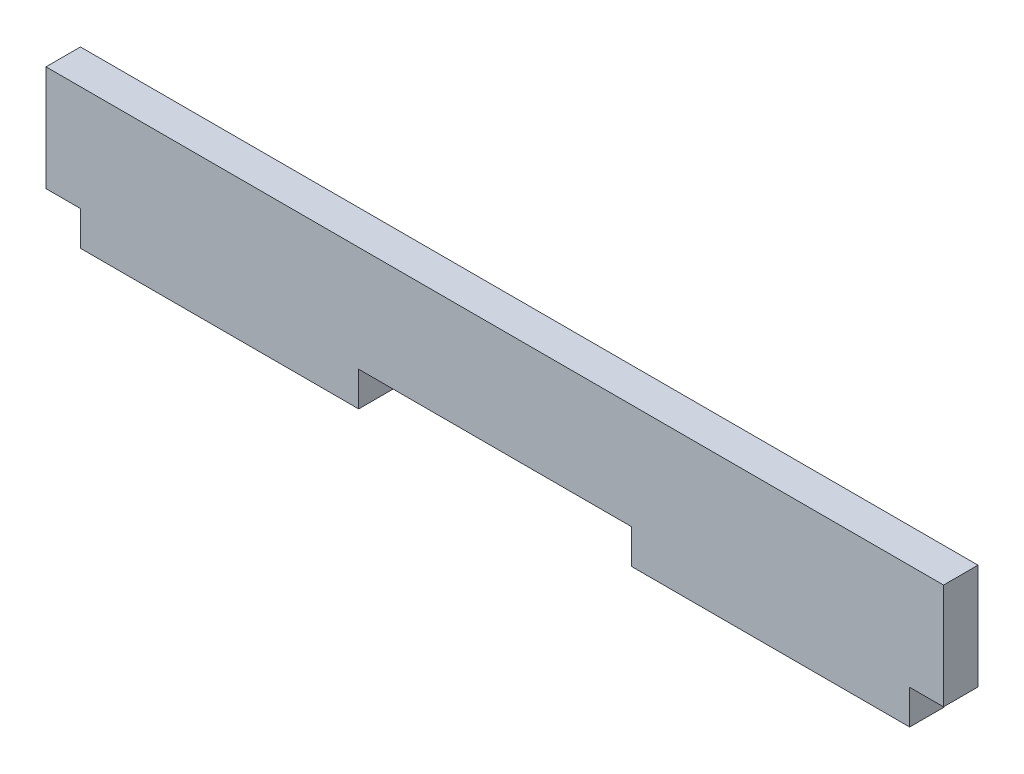
ISO-10303-21;
HEADER;
FILE_DESCRIPTION(('STEP AP214'),'2;1');
FILE_NAME('part.step','',(''),(''),'','','');
FILE_SCHEMA(('AUTOMOTIVE_DESIGN { 1 0 10303 214 1 1 1 1 }'));
ENDSEC;
DATA;
#1=APPLICATION_CONTEXT('core data for automotive mechanical design processes');
#2=APPLICATION_PROTOCOL_DEFINITION('international standard','automotive_design',2000,#1);
#3=PRODUCT_CONTEXT('',#1,'mechanical');
#4=PRODUCT('Part','Part','',(#3));
#5=PRODUCT_RELATED_PRODUCT_CATEGORY('part','',(#4));
#6=PRODUCT_DEFINITION_FORMATION('','',#4);
#7=PRODUCT_DEFINITION_CONTEXT('part definition',#1,'design');
#8=PRODUCT_DEFINITION('design','',#6,#7);
#9=PRODUCT_DEFINITION_SHAPE('','',#8);
#10=(LENGTH_UNIT() NAMED_UNIT(*) SI_UNIT(.MILLI.,.METRE.));
#11=(NAMED_UNIT(*) PLANE_ANGLE_UNIT() SI_UNIT($,.RADIAN.));
#12=(NAMED_UNIT(*) SI_UNIT($,.STERADIAN.) SOLID_ANGLE_UNIT());
#13=UNCERTAINTY_MEASURE_WITH_UNIT(LENGTH_MEASURE(1.E-05),#10,'distance_accuracy_value','');
#14=(GEOMETRIC_REPRESENTATION_CONTEXT(3) GLOBAL_UNCERTAINTY_ASSIGNED_CONTEXT((#13)) GLOBAL_UNIT_ASSIGNED_CONTEXT((#10,
#11,#12)) REPRESENTATION_CONTEXT('',''));
#15=CARTESIAN_POINT('',(0.,0.,0.));
#16=DIRECTION('',(0.,0.,1.));
#17=DIRECTION('',(1.,0.,0.));
#18=AXIS2_PLACEMENT_3D('',#15,#16,#17);
#19=CARTESIAN_POINT('',(38.2524,-8.03909999999999,-1.5875));
#20=DIRECTION('',(1.,0.,0.));
#21=DIRECTION('',(0.,0.,-1.));
#22=AXIS2_PLACEMENT_3D('',#19,#20,#21);
#23=PLANE('',#22);
#24=DIRECTION('',(0.,1.,0.));
#25=VECTOR('',#24,1.);
#26=CARTESIAN_POINT('',(38.2524,-8.03909999999999,1.5875));
#27=LINE('',#26,#25);
#28=CARTESIAN_POINT('',(38.2524,-8.03909999999999,1.5875));
#29=VERTEX_POINT('',#28);
#30=CARTESIAN_POINT('',(38.2524,-4.8641,1.5875));
#31=VERTEX_POINT('',#30);
#32=EDGE_CURVE('E166',#29,#31,#27,.T.);
#33=ORIENTED_EDGE('',*,*,#32,.F.);
#34=DIRECTION('',(0.,0.,1.));
#35=VECTOR('',#34,1.);
#36=CARTESIAN_POINT('',(38.2524,-8.03909999999999,-1.5875));
#37=LINE('',#36,#35);
#38=CARTESIAN_POINT('',(38.2524,-8.03909999999999,-1.5875));
#39=VERTEX_POINT('',#38);
#40=EDGE_CURVE('E11',#39,#29,#37,.T.);
#41=ORIENTED_EDGE('',*,*,#40,.F.);
#42=DIRECTION('',(0.,1.,0.));
#43=VECTOR('',#42,1.);
#44=CARTESIAN_POINT('',(38.2524,-8.03909999999999,-1.5875));
#45=LINE('',#44,#43);
#46=CARTESIAN_POINT('',(38.2524,-4.8641,-1.5875));
#47=VERTEX_POINT('',#46);
#48=EDGE_CURVE('E210',#39,#47,#45,.T.);
#49=ORIENTED_EDGE('',*,*,#48,.T.);
#50=DIRECTION('',(0.,0.,1.));
#51=VECTOR('',#50,1.);
#52=CARTESIAN_POINT('',(38.2524,-4.8641,-1.5875));
#53=LINE('',#52,#51);
#54=EDGE_CURVE('E43',#47,#31,#53,.T.);
#55=ORIENTED_EDGE('',*,*,#54,.T.);
#56=EDGE_LOOP('',(#33,#41,#49,#55));
#57=FACE_BOUND('',#56,.T.);
#58=ADVANCED_FACE('F39',(#57),#23,.T.);
#59=CARTESIAN_POINT('',(12.5984,-8.0391,-1.5875));
#60=DIRECTION('',(0.,-1.,0.));
#61=DIRECTION('',(1.,0.,0.));
#62=AXIS2_PLACEMENT_3D('',#59,#60,#61);
#63=PLANE('',#62);
#64=DIRECTION('',(1.,0.,0.));
#65=VECTOR('',#64,1.);
#66=CARTESIAN_POINT('',(12.5984,-8.0391,1.5875));
#67=LINE('',#66,#65);
#68=CARTESIAN_POINT('',(12.5984,-8.0391,1.5875));
#69=VERTEX_POINT('',#68);
#70=EDGE_CURVE('E207',#69,#29,#67,.T.);
#71=ORIENTED_EDGE('',*,*,#70,.F.);
#72=DIRECTION('',(0.,0.,1.));
#73=VECTOR('',#72,1.);
#74=CARTESIAN_POINT('',(12.5984,-8.0391,-1.5875));
#75=LINE('',#74,#73);
#76=CARTESIAN_POINT('',(12.5984,-8.0391,-1.5875));
#77=VERTEX_POINT('',#76);
#78=EDGE_CURVE('E50',#77,#69,#75,.T.);
#79=ORIENTED_EDGE('',*,*,#78,.F.);
#80=DIRECTION('',(1.,0.,0.));
#81=VECTOR('',#80,1.);
#82=CARTESIAN_POINT('',(12.5984,-8.0391,-1.5875));
#83=LINE('',#82,#81);
#84=EDGE_CURVE('E152',#77,#39,#83,.T.);
#85=ORIENTED_EDGE('',*,*,#84,.T.);
#86=ORIENTED_EDGE('',*,*,#40,.T.);
#87=EDGE_LOOP('',(#71,#79,#85,#86));
#88=FACE_BOUND('',#87,.T.);
#89=ADVANCED_FACE('F240',(#88),#63,.T.);
#90=CARTESIAN_POINT('',(12.5984,-4.8641,-1.5875));
#91=DIRECTION('',(-1.,0.,0.));
#92=DIRECTION('',(0.,0.,1.));
#93=AXIS2_PLACEMENT_3D('',#90,#91,#92);
#94=PLANE('',#93);
#95=DIRECTION('',(0.,-1.,0.));
#96=VECTOR('',#95,1.);
#97=CARTESIAN_POINT('',(12.5984,-4.8641,1.5875));
#98=LINE('',#97,#96);
#99=CARTESIAN_POINT('',(12.5984,-4.8641,1.5875));
#100=VERTEX_POINT('',#99);
#101=EDGE_CURVE('E139',#100,#69,#98,.T.);
#102=ORIENTED_EDGE('',*,*,#101,.F.);
#103=DIRECTION('',(0.,0.,1.));
#104=VECTOR('',#103,1.);
#105=CARTESIAN_POINT('',(12.5984,-4.8641,-1.5875));
#106=LINE('',#105,#104);
#107=CARTESIAN_POINT('',(12.5984,-4.8641,-1.5875));
#108=VERTEX_POINT('',#107);
#109=EDGE_CURVE('E134',#108,#100,#106,.T.);
#110=ORIENTED_EDGE('',*,*,#109,.F.);
#111=DIRECTION('',(0.,-1.,0.));
#112=VECTOR('',#111,1.);
#113=CARTESIAN_POINT('',(12.5984,-4.8641,-1.5875));
#114=LINE('',#113,#112);
#115=EDGE_CURVE('E137',#108,#77,#114,.T.);
#116=ORIENTED_EDGE('',*,*,#115,.T.);
#117=ORIENTED_EDGE('',*,*,#78,.T.);
#118=EDGE_LOOP('',(#102,#110,#116,#117));
#119=FACE_BOUND('',#118,.T.);
#120=ADVANCED_FACE('F136',(#119),#94,.T.);
#121=CARTESIAN_POINT('',(-12.5476,-4.86409999999999,-1.5875));
#122=DIRECTION('',(0.,-1.,0.));
#123=DIRECTION('',(1.,0.,0.));
#124=AXIS2_PLACEMENT_3D('',#121,#122,#123);
#125=PLANE('',#124);
#126=DIRECTION('',(1.,0.,0.));
#127=VECTOR('',#126,1.);
#128=CARTESIAN_POINT('',(-12.5476,-4.86409999999999,1.5875));
#129=LINE('',#128,#127);
#130=CARTESIAN_POINT('',(-12.5476,-4.86409999999999,1.5875));
#131=VERTEX_POINT('',#130);
#132=EDGE_CURVE('E202',#131,#100,#129,.T.);
#133=ORIENTED_EDGE('',*,*,#132,.F.);
#134=DIRECTION('',(0.,0.,1.));
#135=VECTOR('',#134,1.);
#136=CARTESIAN_POINT('',(-12.5476,-4.86409999999999,-1.5875));
#137=LINE('',#136,#135);
#138=CARTESIAN_POINT('',(-12.5476,-4.86409999999999,-1.5875));
#139=VERTEX_POINT('',#138);
#140=EDGE_CURVE('E145',#139,#131,#137,.T.);
#141=ORIENTED_EDGE('',*,*,#140,.F.);
#142=DIRECTION('',(1.,0.,0.));
#143=VECTOR('',#142,1.);
#144=CARTESIAN_POINT('',(-12.5476,-4.86409999999999,-1.5875));
#145=LINE('',#144,#143);
#146=EDGE_CURVE('E150',#139,#108,#145,.T.);
#147=ORIENTED_EDGE('',*,*,#146,.T.);
#148=ORIENTED_EDGE('',*,*,#109,.T.);
#149=EDGE_LOOP('',(#133,#141,#147,#148));
#150=FACE_BOUND('',#149,.T.);
#151=ADVANCED_FACE('F155',(#150),#125,.T.);
#152=CARTESIAN_POINT('',(-12.5476,-8.0391,-1.5875));
#153=DIRECTION('',(1.,0.,0.));
#154=DIRECTION('',(0.,1.,0.));
#155=AXIS2_PLACEMENT_3D('',#152,#153,#154);
#156=PLANE('',#155);
#157=DIRECTION('',(0.,1.,0.));
#158=VECTOR('',#157,1.);
#159=CARTESIAN_POINT('',(-12.5476,-8.0391,1.5875));
#160=LINE('',#159,#158);
#161=CARTESIAN_POINT('',(-12.5476,-8.0391,1.5875));
#162=VERTEX_POINT('',#161);
#163=EDGE_CURVE('E198',#162,#131,#160,.T.);
#164=ORIENTED_EDGE('',*,*,#163,.F.);
#165=DIRECTION('',(0.,0.,1.));
#166=VECTOR('',#165,1.);
#167=CARTESIAN_POINT('',(-12.5476,-8.0391,-1.5875));
#168=LINE('',#167,#166);
#169=CARTESIAN_POINT('',(-12.5476,-8.0391,-1.5875));
#170=VERTEX_POINT('',#169);
#171=EDGE_CURVE('E216',#170,#162,#168,.T.);
#172=ORIENTED_EDGE('',*,*,#171,.F.);
#173=DIRECTION('',(0.,1.,0.));
#174=VECTOR('',#173,1.);
#175=CARTESIAN_POINT('',(-12.5476,-8.0391,-1.5875));
#176=LINE('',#175,#174);
#177=EDGE_CURVE('E157',#170,#139,#176,.T.);
#178=ORIENTED_EDGE('',*,*,#177,.T.);
#179=ORIENTED_EDGE('',*,*,#140,.T.);
#180=EDGE_LOOP('',(#164,#172,#178,#179));
#181=FACE_BOUND('',#180,.T.);
#182=ADVANCED_FACE('F252',(#181),#156,.T.);
#183=CARTESIAN_POINT('',(-38.2016,-8.0391,-1.5875));
#184=DIRECTION('',(0.,-1.,0.));
#185=DIRECTION('',(1.,0.,0.));
#186=AXIS2_PLACEMENT_3D('',#183,#184,#185);
#187=PLANE('',#186);
#188=DIRECTION('',(1.,0.,0.));
#189=VECTOR('',#188,1.);
#190=CARTESIAN_POINT('',(-38.2016,-8.0391,1.5875));
#191=LINE('',#190,#189);
#192=CARTESIAN_POINT('',(-38.2016,-8.0391,1.5875));
#193=VERTEX_POINT('',#192);
#194=EDGE_CURVE('E194',#193,#162,#191,.T.);
#195=ORIENTED_EDGE('',*,*,#194,.F.);
#196=DIRECTION('',(0.,0.,1.));
#197=VECTOR('',#196,1.);
#198=CARTESIAN_POINT('',(-38.2016,-8.0391,-1.5875));
#199=LINE('',#198,#197);
#200=CARTESIAN_POINT('',(-38.2016,-8.0391,-1.5875));
#201=VERTEX_POINT('',#200);
#202=EDGE_CURVE('E219',#201,#193,#199,.T.);
#203=ORIENTED_EDGE('',*,*,#202,.F.);
#204=DIRECTION('',(1.,0.,0.));
#205=VECTOR('',#204,1.);
#206=CARTESIAN_POINT('',(-38.2016,-8.0391,-1.5875));
#207=LINE('',#206,#205);
#208=EDGE_CURVE('E160',#201,#170,#207,.T.);
#209=ORIENTED_EDGE('',*,*,#208,.T.);
#210=ORIENTED_EDGE('',*,*,#171,.T.);
#211=EDGE_LOOP('',(#195,#203,#209,#210));
#212=FACE_BOUND('',#211,.T.);
#213=ADVANCED_FACE('F255',(#212),#187,.T.);
#214=CARTESIAN_POINT('',(-38.2016,-4.8641,-1.5875));
#215=DIRECTION('',(-1.,0.,0.));
#216=DIRECTION('',(0.,0.,1.));
#217=AXIS2_PLACEMENT_3D('',#214,#215,#216);
#218=PLANE('',#217);
#219=DIRECTION('',(0.,-1.,0.));
#220=VECTOR('',#219,1.);
#221=CARTESIAN_POINT('',(-38.2016,-4.8641,1.5875));
#222=LINE('',#221,#220);
#223=CARTESIAN_POINT('',(-38.2016,-4.8641,1.5875));
#224=VERTEX_POINT('',#223);
#225=EDGE_CURVE('E190',#224,#193,#222,.T.);
#226=ORIENTED_EDGE('',*,*,#225,.F.);
#227=DIRECTION('',(0.,0.,1.));
#228=VECTOR('',#227,1.);
#229=CARTESIAN_POINT('',(-38.2016,-4.8641,-1.5875));
#230=LINE('',#229,#228);
#231=CARTESIAN_POINT('',(-38.2016,-4.8641,-1.5875));
#232=VERTEX_POINT('',#231);
#233=EDGE_CURVE('E222',#232,#224,#230,.T.);
#234=ORIENTED_EDGE('',*,*,#233,.F.);
#235=DIRECTION('',(0.,-1.,0.));
#236=VECTOR('',#235,1.);
#237=CARTESIAN_POINT('',(-38.2016,-4.8641,-1.5875));
#238=LINE('',#237,#236);
#239=EDGE_CURVE('E388',#232,#201,#238,.T.);
#240=ORIENTED_EDGE('',*,*,#239,.T.);
#241=ORIENTED_EDGE('',*,*,#202,.T.);
#242=EDGE_LOOP('',(#226,#234,#240,#241));
#243=FACE_BOUND('',#242,.T.);
#244=ADVANCED_FACE('F259',(#243),#218,.T.);
#245=CARTESIAN_POINT('',(-41.3766,-4.8641,-1.5875));
#246=DIRECTION('',(0.,-1.,0.));
#247=DIRECTION('',(0.,0.,-1.));
#248=AXIS2_PLACEMENT_3D('',#245,#246,#247);
#249=PLANE('',#248);
#250=DIRECTION('',(1.,0.,0.));
#251=VECTOR('',#250,1.);
#252=CARTESIAN_POINT('',(-41.3766,-4.8641,1.5875));
#253=LINE('',#252,#251);
#254=CARTESIAN_POINT('',(-41.3766,-4.8641,1.5875));
#255=VERTEX_POINT('',#254);
#256=EDGE_CURVE('E186',#255,#224,#253,.T.);
#257=ORIENTED_EDGE('',*,*,#256,.F.);
#258=DIRECTION('',(0.,0.,1.));
#259=VECTOR('',#258,1.);
#260=CARTESIAN_POINT('',(-41.3766,-4.8641,-1.5875));
#261=LINE('',#260,#259);
#262=CARTESIAN_POINT('',(-41.3766,-4.8641,-1.5875));
#263=VERTEX_POINT('',#262);
#264=EDGE_CURVE('E225',#263,#255,#261,.T.);
#265=ORIENTED_EDGE('',*,*,#264,.F.);
#266=DIRECTION('',(1.,0.,0.));
#267=VECTOR('',#266,1.);
#268=CARTESIAN_POINT('',(-41.3766,-4.8641,-1.5875));
#269=LINE('',#268,#267);
#270=EDGE_CURVE('E394',#263,#232,#269,.T.);
#271=ORIENTED_EDGE('',*,*,#270,.T.);
#272=ORIENTED_EDGE('',*,*,#233,.T.);
#273=EDGE_LOOP('',(#257,#265,#271,#272));
#274=FACE_BOUND('',#273,.T.);
#275=ADVANCED_FACE('F263',(#274),#249,.T.);
#276=CARTESIAN_POINT('',(-41.3766,4.8641,-1.5875));
#277=DIRECTION('',(-1.,0.,0.));
#278=DIRECTION('',(0.,0.,1.));
#279=AXIS2_PLACEMENT_3D('',#276,#277,#278);
#280=PLANE('',#279);
#281=DIRECTION('',(0.,-1.,0.));
#282=VECTOR('',#281,1.);
#283=CARTESIAN_POINT('',(-41.3766,4.8641,1.5875));
#284=LINE('',#283,#282);
#285=CARTESIAN_POINT('',(-41.3766,4.8641,1.5875));
#286=VERTEX_POINT('',#285);
#287=EDGE_CURVE('E182',#286,#255,#284,.T.);
#288=ORIENTED_EDGE('',*,*,#287,.F.);
#289=DIRECTION('',(0.,0.,1.));
#290=VECTOR('',#289,1.);
#291=CARTESIAN_POINT('',(-41.3766,4.8641,-1.5875));
#292=LINE('',#291,#290);
#293=CARTESIAN_POINT('',(-41.3766,4.8641,-1.5875));
#294=VERTEX_POINT('',#293);
#295=EDGE_CURVE('E228',#294,#286,#292,.T.);
#296=ORIENTED_EDGE('',*,*,#295,.F.);
#297=DIRECTION('',(0.,-1.,0.));
#298=VECTOR('',#297,1.);
#299=CARTESIAN_POINT('',(-41.3766,4.8641,-1.5875));
#300=LINE('',#299,#298);
#301=EDGE_CURVE('E381',#294,#263,#300,.T.);
#302=ORIENTED_EDGE('',*,*,#301,.T.);
#303=ORIENTED_EDGE('',*,*,#264,.T.);
#304=EDGE_LOOP('',(#288,#296,#302,#303));
#305=FACE_BOUND('',#304,.T.);
#306=ADVANCED_FACE('F267',(#305),#280,.T.);
#307=CARTESIAN_POINT('',(41.3766,4.8641,-1.5875));
#308=DIRECTION('',(0.,1.,0.));
#309=DIRECTION('',(0.,0.,1.));
#310=AXIS2_PLACEMENT_3D('',#307,#308,#309);
#311=PLANE('',#310);
#312=DIRECTION('',(-1.,0.,0.));
#313=VECTOR('',#312,1.);
#314=CARTESIAN_POINT('',(41.3766,4.8641,1.5875));
#315=LINE('',#314,#313);
#316=CARTESIAN_POINT('',(41.3766,4.8641,1.5875));
#317=VERTEX_POINT('',#316);
#318=EDGE_CURVE('E178',#317,#286,#315,.T.);
#319=ORIENTED_EDGE('',*,*,#318,.F.);
#320=DIRECTION('',(0.,0.,1.));
#321=VECTOR('',#320,1.);
#322=CARTESIAN_POINT('',(41.3766,4.8641,-1.5875));
#323=LINE('',#322,#321);
#324=CARTESIAN_POINT('',(41.3766,4.8641,-1.5875));
#325=VERTEX_POINT('',#324);
#326=EDGE_CURVE('E231',#325,#317,#323,.T.);
#327=ORIENTED_EDGE('',*,*,#326,.F.);
#328=DIRECTION('',(-1.,0.,0.));
#329=VECTOR('',#328,1.);
#330=CARTESIAN_POINT('',(41.3766,4.8641,-1.5875));
#331=LINE('',#330,#329);
#332=EDGE_CURVE('E377',#325,#294,#331,.T.);
#333=ORIENTED_EDGE('',*,*,#332,.T.);
#334=ORIENTED_EDGE('',*,*,#295,.T.);
#335=EDGE_LOOP('',(#319,#327,#333,#334));
#336=FACE_BOUND('',#335,.T.);
#337=ADVANCED_FACE('F271',(#336),#311,.T.);
#338=CARTESIAN_POINT('',(41.3766,-4.8641,-1.5875));
#339=DIRECTION('',(1.,0.,0.));
#340=DIRECTION('',(0.,0.,-1.));
#341=AXIS2_PLACEMENT_3D('',#338,#339,#340);
#342=PLANE('',#341);
#343=DIRECTION('',(0.,1.,0.));
#344=VECTOR('',#343,1.);
#345=CARTESIAN_POINT('',(41.3766,-4.8641,1.5875));
#346=LINE('',#345,#344);
#347=CARTESIAN_POINT('',(41.3766,-4.8641,1.5875));
#348=VERTEX_POINT('',#347);
#349=EDGE_CURVE('E174',#348,#317,#346,.T.);
#350=ORIENTED_EDGE('',*,*,#349,.F.);
#351=DIRECTION('',(0.,0.,1.));
#352=VECTOR('',#351,1.);
#353=CARTESIAN_POINT('',(41.3766,-4.8641,-1.5875));
#354=LINE('',#353,#352);
#355=CARTESIAN_POINT('',(41.3766,-4.8641,-1.5875));
#356=VERTEX_POINT('',#355);
#357=EDGE_CURVE('E233',#356,#348,#354,.T.);
#358=ORIENTED_EDGE('',*,*,#357,.F.);
#359=DIRECTION('',(0.,1.,0.));
#360=VECTOR('',#359,1.);
#361=CARTESIAN_POINT('',(41.3766,-4.8641,-1.5875));
#362=LINE('',#361,#360);
#363=EDGE_CURVE('E403',#356,#325,#362,.T.);
#364=ORIENTED_EDGE('',*,*,#363,.T.);
#365=ORIENTED_EDGE('',*,*,#326,.T.);
#366=EDGE_LOOP('',(#350,#358,#364,#365));
#367=FACE_BOUND('',#366,.T.);
#368=ADVANCED_FACE('F275',(#367),#342,.T.);
#369=CARTESIAN_POINT('',(38.2524,-4.8641,-1.5875));
#370=DIRECTION('',(0.,-1.,0.));
#371=DIRECTION('',(1.,0.,0.));
#372=AXIS2_PLACEMENT_3D('',#369,#370,#371);
#373=PLANE('',#372);
#374=DIRECTION('',(1.,0.,0.));
#375=VECTOR('',#374,1.);
#376=CARTESIAN_POINT('',(38.2524,-4.8641,1.5875));
#377=LINE('',#376,#375);
#378=EDGE_CURVE('E170',#31,#348,#377,.T.);
#379=ORIENTED_EDGE('',*,*,#378,.F.);
#380=ORIENTED_EDGE('',*,*,#54,.F.);
#381=DIRECTION('',(1.,0.,0.));
#382=VECTOR('',#381,1.);
#383=CARTESIAN_POINT('',(38.2524,-4.8641,-1.5875));
#384=LINE('',#383,#382);
#385=EDGE_CURVE('E406',#47,#356,#384,.T.);
#386=ORIENTED_EDGE('',*,*,#385,.T.);
#387=ORIENTED_EDGE('',*,*,#357,.T.);
#388=EDGE_LOOP('',(#379,#380,#386,#387));
#389=FACE_BOUND('',#388,.T.);
#390=ADVANCED_FACE('F237',(#389),#373,.T.);
#391=CARTESIAN_POINT('',(0.,0.,1.5875));
#392=DIRECTION('',(0.,0.,-1.));
#393=DIRECTION('',(-1.,0.,0.));
#394=AXIS2_PLACEMENT_3D('',#391,#392,#393);
#395=PLANE('',#394);
#396=ORIENTED_EDGE('',*,*,#32,.T.);
#397=ORIENTED_EDGE('',*,*,#378,.T.);
#398=ORIENTED_EDGE('',*,*,#349,.T.);
#399=ORIENTED_EDGE('',*,*,#318,.T.);
#400=ORIENTED_EDGE('',*,*,#287,.T.);
#401=ORIENTED_EDGE('',*,*,#256,.T.);
#402=ORIENTED_EDGE('',*,*,#225,.T.);
#403=ORIENTED_EDGE('',*,*,#194,.T.);
#404=ORIENTED_EDGE('',*,*,#163,.T.);
#405=ORIENTED_EDGE('',*,*,#132,.T.);
#406=ORIENTED_EDGE('',*,*,#101,.T.);
#407=ORIENTED_EDGE('',*,*,#70,.T.);
#408=EDGE_LOOP('',(#396,#397,#398,#399,#400,#401,#402,#403,#404,#405,#406,#407));
#409=FACE_BOUND('',#408,.T.);
#410=ADVANCED_FACE('F239',(#409),#395,.F.);
#411=CARTESIAN_POINT('',(0.,0.,-1.5875));
#412=DIRECTION('',(0.,0.,-1.));
#413=DIRECTION('',(-1.,0.,0.));
#414=AXIS2_PLACEMENT_3D('',#411,#412,#413);
#415=PLANE('',#414);
#416=ORIENTED_EDGE('',*,*,#48,.F.);
#417=ORIENTED_EDGE('',*,*,#84,.F.);
#418=ORIENTED_EDGE('',*,*,#115,.F.);
#419=ORIENTED_EDGE('',*,*,#146,.F.);
#420=ORIENTED_EDGE('',*,*,#177,.F.);
#421=ORIENTED_EDGE('',*,*,#208,.F.);
#422=ORIENTED_EDGE('',*,*,#239,.F.);
#423=ORIENTED_EDGE('',*,*,#270,.F.);
#424=ORIENTED_EDGE('',*,*,#301,.F.);
#425=ORIENTED_EDGE('',*,*,#332,.F.);
#426=ORIENTED_EDGE('',*,*,#363,.F.);
#427=ORIENTED_EDGE('',*,*,#385,.F.);
#428=EDGE_LOOP('',(#416,#417,#418,#419,#420,#421,#422,#423,#424,#425,#426,#427));
#429=FACE_BOUND('',#428,.T.);
#430=ADVANCED_FACE('F41',(#429),#415,.T.);
#431=CLOSED_SHELL('',(#58,#89,#120,#151,#182,#213,#244,#275,#306,#337,#368,#390,#410,#430));
#432=MANIFOLD_SOLID_BREP('B2',#431);
#433=ADVANCED_BREP_SHAPE_REPRESENTATION('',(#18,#432),#14);
#434=SHAPE_DEFINITION_REPRESENTATION(#9,#433);
ENDSEC;
END-ISO-10303-21;
